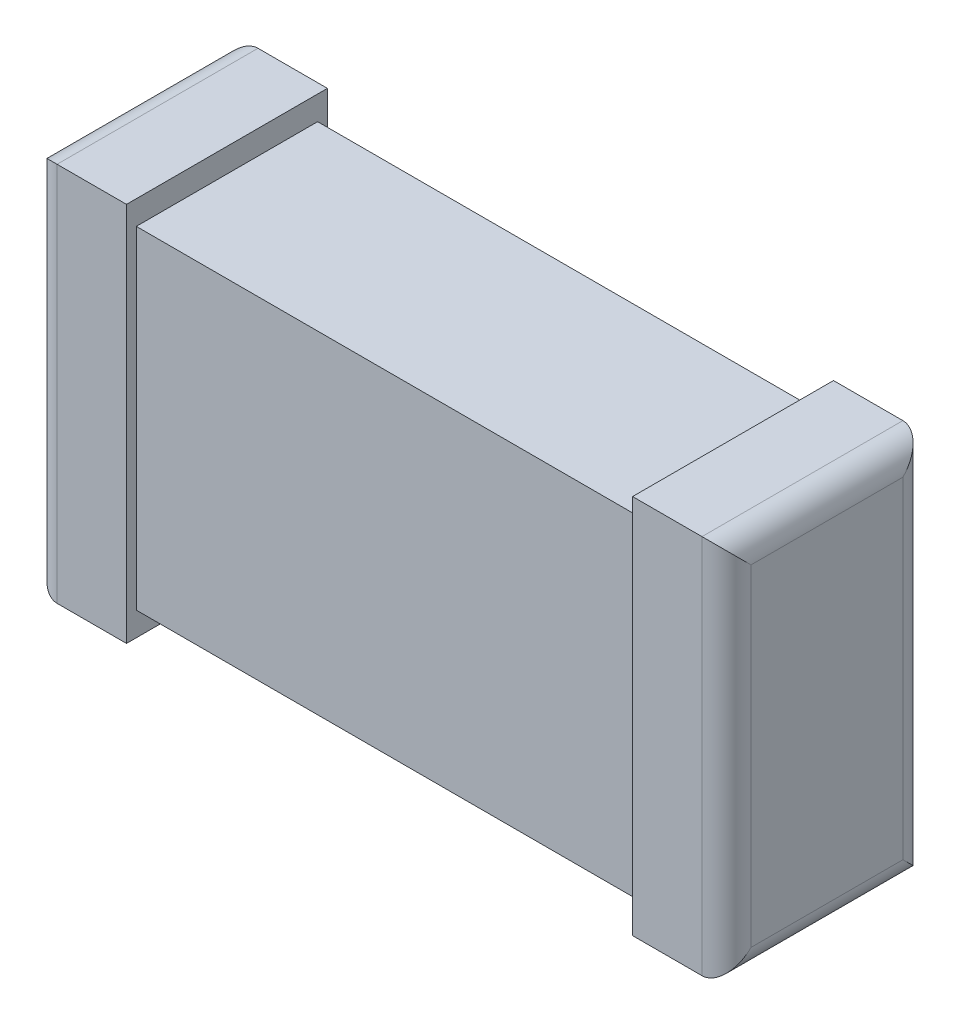
ISO-10303-21;
HEADER;
FILE_DESCRIPTION(('STEP AP214'),'2;1');
FILE_NAME('part.step','',(''),(''),'','','');
FILE_SCHEMA(('AUTOMOTIVE_DESIGN { 1 0 10303 214 1 1 1 1 }'));
ENDSEC;
DATA;
#1=APPLICATION_CONTEXT('core data for automotive mechanical design processes');
#2=APPLICATION_PROTOCOL_DEFINITION('international standard','automotive_design',2000,#1);
#3=PRODUCT_CONTEXT('',#1,'mechanical');
#4=PRODUCT('Part','Part','',(#3));
#5=PRODUCT_RELATED_PRODUCT_CATEGORY('part','',(#4));
#6=PRODUCT_DEFINITION_FORMATION('','',#4);
#7=PRODUCT_DEFINITION_CONTEXT('part definition',#1,'design');
#8=PRODUCT_DEFINITION('design','',#6,#7);
#9=PRODUCT_DEFINITION_SHAPE('','',#8);
#10=(LENGTH_UNIT() NAMED_UNIT(*) SI_UNIT(.MILLI.,.METRE.));
#11=(NAMED_UNIT(*) PLANE_ANGLE_UNIT() SI_UNIT($,.RADIAN.));
#12=(NAMED_UNIT(*) SI_UNIT($,.STERADIAN.) SOLID_ANGLE_UNIT());
#13=UNCERTAINTY_MEASURE_WITH_UNIT(LENGTH_MEASURE(1.E-05),#10,'distance_accuracy_value','');
#14=(GEOMETRIC_REPRESENTATION_CONTEXT(3) GLOBAL_UNCERTAINTY_ASSIGNED_CONTEXT((#13)) GLOBAL_UNIT_ASSIGNED_CONTEXT((#10,
#11,#12)) REPRESENTATION_CONTEXT('',''));
#15=CARTESIAN_POINT('',(0.,0.,0.));
#16=DIRECTION('',(0.,0.,1.));
#17=DIRECTION('',(1.,0.,0.));
#18=AXIS2_PLACEMENT_3D('',#15,#16,#17);
#19=CARTESIAN_POINT('',(-2.5818060220749,-1.69545951022299,0.));
#20=DIRECTION('',(0.,1.,0.));
#21=DIRECTION('',(-1.,0.,0.));
#22=AXIS2_PLACEMENT_3D('',#19,#20,#21);
#23=PLANE('',#22);
#24=DIRECTION('',(-1.,0.,0.));
#25=VECTOR('',#24,1.);
#26=CARTESIAN_POINT('',(2.5818060220749,-1.69545951022299,0.1));
#27=LINE('',#26,#25);
#28=CARTESIAN_POINT('',(2.5818060220749,-1.69545951022299,0.1));
#29=VERTEX_POINT('',#28);
#30=CARTESIAN_POINT('',(-2.5818060220749,-1.69545951022299,0.1));
#31=VERTEX_POINT('',#30);
#32=EDGE_CURVE('E173',#29,#31,#27,.T.);
#33=ORIENTED_EDGE('',*,*,#32,.F.);
#34=DIRECTION('',(0.,0.,1.));
#35=VECTOR('',#34,1.);
#36=CARTESIAN_POINT('',(2.5818060220749,-1.69545951022298,0.));
#37=LINE('',#36,#35);
#38=CARTESIAN_POINT('',(2.5818060220749,-1.69545951022299,1.95));
#39=VERTEX_POINT('',#38);
#40=EDGE_CURVE('E210',#29,#39,#37,.T.);
#41=ORIENTED_EDGE('',*,*,#40,.T.);
#42=DIRECTION('',(1.,0.,0.));
#43=VECTOR('',#42,1.);
#44=CARTESIAN_POINT('',(2.5818060220749,-1.69545951022299,1.95));
#45=LINE('',#44,#43);
#46=CARTESIAN_POINT('',(-2.5818060220749,-1.69545951022299,1.95));
#47=VERTEX_POINT('',#46);
#48=EDGE_CURVE('E409',#47,#39,#45,.T.);
#49=ORIENTED_EDGE('',*,*,#48,.F.);
#50=DIRECTION('',(0.,0.,1.));
#51=VECTOR('',#50,1.);
#52=CARTESIAN_POINT('',(-2.5818060220749,-1.69545951022299,0.));
#53=LINE('',#52,#51);
#54=EDGE_CURVE('E207',#31,#47,#53,.T.);
#55=ORIENTED_EDGE('',*,*,#54,.F.);
#56=EDGE_LOOP('',(#33,#41,#49,#55));
#57=FACE_BOUND('',#56,.T.);
#58=ADVANCED_FACE('F45',(#57),#23,.F.);
#59=CARTESIAN_POINT('',(-2.5818060220749,1.69545951022299,0.));
#60=DIRECTION('',(0.,-1.,0.));
#61=DIRECTION('',(0.,0.,-1.));
#62=AXIS2_PLACEMENT_3D('',#59,#60,#61);
#63=PLANE('',#62);
#64=DIRECTION('',(1.,0.,0.));
#65=VECTOR('',#64,1.);
#66=CARTESIAN_POINT('',(2.5818060220749,1.69545951022299,0.1));
#67=LINE('',#66,#65);
#68=CARTESIAN_POINT('',(-2.5818060220749,1.69545951022299,0.1));
#69=VERTEX_POINT('',#68);
#70=CARTESIAN_POINT('',(2.5818060220749,1.69545951022299,0.1));
#71=VERTEX_POINT('',#70);
#72=EDGE_CURVE('E170',#69,#71,#67,.T.);
#73=ORIENTED_EDGE('',*,*,#72,.F.);
#74=DIRECTION('',(0.,0.,1.));
#75=VECTOR('',#74,1.);
#76=CARTESIAN_POINT('',(-2.5818060220749,1.69545951022299,0.));
#77=LINE('',#76,#75);
#78=CARTESIAN_POINT('',(-2.5818060220749,1.69545951022299,1.95));
#79=VERTEX_POINT('',#78);
#80=EDGE_CURVE('E183',#69,#79,#77,.T.);
#81=ORIENTED_EDGE('',*,*,#80,.T.);
#82=DIRECTION('',(-1.,0.,0.));
#83=VECTOR('',#82,1.);
#84=CARTESIAN_POINT('',(2.5818060220749,1.69545951022299,1.95));
#85=LINE('',#84,#83);
#86=CARTESIAN_POINT('',(2.5818060220749,1.69545951022299,1.95));
#87=VERTEX_POINT('',#86);
#88=EDGE_CURVE('E213',#87,#79,#85,.T.);
#89=ORIENTED_EDGE('',*,*,#88,.F.);
#90=DIRECTION('',(0.,0.,1.));
#91=VECTOR('',#90,1.);
#92=CARTESIAN_POINT('',(2.5818060220749,1.69545951022299,0.));
#93=LINE('',#92,#91);
#94=EDGE_CURVE('E185',#71,#87,#93,.T.);
#95=ORIENTED_EDGE('',*,*,#94,.F.);
#96=EDGE_LOOP('',(#73,#81,#89,#95));
#97=FACE_BOUND('',#96,.T.);
#98=ADVANCED_FACE('F181',(#97),#63,.F.);
#99=CARTESIAN_POINT('',(0.,0.,0.));
#100=DIRECTION('',(0.,0.,-1.));
#101=DIRECTION('',(-1.,0.,0.));
#102=AXIS2_PLACEMENT_3D('',#99,#100,#101);
#103=PLANE('',#102);
#104=DIRECTION('',(1.,0.,0.));
#105=VECTOR('',#104,1.);
#106=CARTESIAN_POINT('',(-3.54,-1.94,0.));
#107=LINE('',#106,#105);
#108=CARTESIAN_POINT('',(-3.29,-1.94,0.));
#109=VERTEX_POINT('',#108);
#110=CARTESIAN_POINT('',(-2.5818060220749,-1.94,0.));
#111=VERTEX_POINT('',#110);
#112=EDGE_CURVE('E243',#109,#111,#107,.T.);
#113=ORIENTED_EDGE('',*,*,#112,.F.);
#114=DIRECTION('',(0.,-1.,0.));
#115=VECTOR('',#114,1.);
#116=CARTESIAN_POINT('',(-3.29,1.94,0.));
#117=LINE('',#116,#115);
#118=CARTESIAN_POINT('',(-3.29,1.94,0.));
#119=VERTEX_POINT('',#118);
#120=EDGE_CURVE('E292',#109,#119,#117,.F.);
#121=ORIENTED_EDGE('',*,*,#120,.T.);
#122=DIRECTION('',(-1.,0.,0.));
#123=VECTOR('',#122,1.);
#124=CARTESIAN_POINT('',(-3.54,1.94,0.));
#125=LINE('',#124,#123);
#126=CARTESIAN_POINT('',(-2.5818060220749,1.94,0.));
#127=VERTEX_POINT('',#126);
#128=EDGE_CURVE('E229',#127,#119,#125,.T.);
#129=ORIENTED_EDGE('',*,*,#128,.F.);
#130=DIRECTION('',(0.,1.,0.));
#131=VECTOR('',#130,1.);
#132=CARTESIAN_POINT('',(-2.5818060220749,0.,0.));
#133=LINE('',#132,#131);
#134=EDGE_CURVE('E248',#111,#127,#133,.T.);
#135=ORIENTED_EDGE('',*,*,#134,.F.);
#136=EDGE_LOOP('',(#113,#121,#129,#135));
#137=FACE_BOUND('',#136,.T.);
#138=ADVANCED_FACE('F338',(#137),#103,.T.);
#139=CARTESIAN_POINT('',(0.,0.,2.05));
#140=DIRECTION('',(0.,0.,-1.));
#141=DIRECTION('',(-1.,0.,0.));
#142=AXIS2_PLACEMENT_3D('',#139,#140,#141);
#143=PLANE('',#142);
#144=DIRECTION('',(-1.,0.,0.));
#145=VECTOR('',#144,1.);
#146=CARTESIAN_POINT('',(-3.54,1.94,2.05));
#147=LINE('',#146,#145);
#148=CARTESIAN_POINT('',(-2.5818060220749,1.94,2.05));
#149=VERTEX_POINT('',#148);
#150=CARTESIAN_POINT('',(-3.29,1.94,2.05));
#151=VERTEX_POINT('',#150);
#152=EDGE_CURVE('E234',#149,#151,#147,.T.);
#153=ORIENTED_EDGE('',*,*,#152,.T.);
#154=DIRECTION('',(0.,-1.,0.));
#155=VECTOR('',#154,1.);
#156=CARTESIAN_POINT('',(-3.29,0.,2.05));
#157=LINE('',#156,#155);
#158=CARTESIAN_POINT('',(-3.29,-1.94,2.05));
#159=VERTEX_POINT('',#158);
#160=EDGE_CURVE('E11',#151,#159,#157,.T.);
#161=ORIENTED_EDGE('',*,*,#160,.T.);
#162=DIRECTION('',(1.,0.,0.));
#163=VECTOR('',#162,1.);
#164=CARTESIAN_POINT('',(-3.54,-1.94,2.05));
#165=LINE('',#164,#163);
#166=CARTESIAN_POINT('',(-2.5818060220749,-1.94,2.05));
#167=VERTEX_POINT('',#166);
#168=EDGE_CURVE('E235',#159,#167,#165,.T.);
#169=ORIENTED_EDGE('',*,*,#168,.T.);
#170=DIRECTION('',(0.,-1.,0.));
#171=VECTOR('',#170,1.);
#172=CARTESIAN_POINT('',(-2.5818060220749,2.18454048977701,2.05));
#173=LINE('',#172,#171);
#174=EDGE_CURVE('E195',#149,#167,#173,.T.);
#175=ORIENTED_EDGE('',*,*,#174,.F.);
#176=EDGE_LOOP('',(#153,#161,#169,#175));
#177=FACE_BOUND('',#176,.T.);
#178=ADVANCED_FACE('F379',(#177),#143,.F.);
#179=CARTESIAN_POINT('',(-3.54,1.94,2.05));
#180=DIRECTION('',(0.,-1.,0.));
#181=DIRECTION('',(0.,0.,-1.));
#182=AXIS2_PLACEMENT_3D('',#179,#180,#181);
#183=PLANE('',#182);
#184=CARTESIAN_POINT('',(3.29,1.94,2.05));
#185=VERTEX_POINT('',#184);
#186=CARTESIAN_POINT('',(2.5818060220749,1.94,2.05));
#187=VERTEX_POINT('',#186);
#188=EDGE_CURVE('E230',#185,#187,#147,.T.);
#189=ORIENTED_EDGE('',*,*,#188,.F.);
#190=DIRECTION('',(0.,0.,-1.));
#191=VECTOR('',#190,1.);
#192=CARTESIAN_POINT('',(3.29,1.94,2.05));
#193=LINE('',#192,#191);
#194=CARTESIAN_POINT('',(3.29,1.94,0.));
#195=VERTEX_POINT('',#194);
#196=EDGE_CURVE('E272',#185,#195,#193,.T.);
#197=ORIENTED_EDGE('',*,*,#196,.T.);
#198=CARTESIAN_POINT('',(2.5818060220749,1.94,0.));
#199=VERTEX_POINT('',#198);
#200=EDGE_CURVE('E239',#195,#199,#125,.T.);
#201=ORIENTED_EDGE('',*,*,#200,.T.);
#202=DIRECTION('',(0.,0.,1.));
#203=VECTOR('',#202,1.);
#204=CARTESIAN_POINT('',(2.5818060220749,1.94,2.05));
#205=LINE('',#204,#203);
#206=EDGE_CURVE('E225',#199,#187,#205,.T.);
#207=ORIENTED_EDGE('',*,*,#206,.T.);
#208=EDGE_LOOP('',(#189,#197,#201,#207));
#209=FACE_BOUND('',#208,.T.);
#210=ADVANCED_FACE('F363',(#209),#183,.F.);
#211=CARTESIAN_POINT('',(-3.54,-1.94,2.05));
#212=DIRECTION('',(0.,1.,0.));
#213=DIRECTION('',(0.,0.,1.));
#214=AXIS2_PLACEMENT_3D('',#211,#212,#213);
#215=PLANE('',#214);
#216=ORIENTED_EDGE('',*,*,#168,.F.);
#217=DIRECTION('',(0.,0.,-1.));
#218=VECTOR('',#217,1.);
#219=CARTESIAN_POINT('',(-3.29,-1.94,2.05));
#220=LINE('',#219,#218);
#221=EDGE_CURVE('E55',#159,#109,#220,.T.);
#222=ORIENTED_EDGE('',*,*,#221,.T.);
#223=ORIENTED_EDGE('',*,*,#112,.T.);
#224=DIRECTION('',(0.,0.,1.));
#225=VECTOR('',#224,1.);
#226=CARTESIAN_POINT('',(-2.5818060220749,-1.94,2.05));
#227=LINE('',#226,#225);
#228=EDGE_CURVE('E217',#111,#167,#227,.T.);
#229=ORIENTED_EDGE('',*,*,#228,.T.);
#230=EDGE_LOOP('',(#216,#222,#223,#229));
#231=FACE_BOUND('',#230,.T.);
#232=ADVANCED_FACE('F360',(#231),#215,.F.);
#233=CARTESIAN_POINT('',(3.54,-1.94,2.05));
#234=DIRECTION('',(-1.,0.,0.));
#235=DIRECTION('',(0.,0.,1.));
#236=AXIS2_PLACEMENT_3D('',#233,#234,#235);
#237=PLANE('',#236);
#238=DIRECTION('',(0.,1.,0.));
#239=VECTOR('',#238,1.);
#240=CARTESIAN_POINT('',(3.54,-1.94,1.8));
#241=LINE('',#240,#239);
#242=CARTESIAN_POINT('',(3.54,1.69,1.8));
#243=VERTEX_POINT('',#242);
#244=CARTESIAN_POINT('',(3.54,-1.69,1.8));
#245=VERTEX_POINT('',#244);
#246=EDGE_CURVE('E253',#243,#245,#241,.F.);
#247=ORIENTED_EDGE('',*,*,#246,.T.);
#248=DIRECTION('',(0.,0.,-1.));
#249=VECTOR('',#248,1.);
#250=CARTESIAN_POINT('',(3.54,-1.69,2.05));
#251=LINE('',#250,#249);
#252=CARTESIAN_POINT('',(3.54,-1.69,0.25));
#253=VERTEX_POINT('',#252);
#254=EDGE_CURVE('E259',#245,#253,#251,.T.);
#255=ORIENTED_EDGE('',*,*,#254,.T.);
#256=DIRECTION('',(0.,1.,0.));
#257=VECTOR('',#256,1.);
#258=CARTESIAN_POINT('',(3.54,1.94,0.25));
#259=LINE('',#258,#257);
#260=CARTESIAN_POINT('',(3.54,1.69,0.25));
#261=VERTEX_POINT('',#260);
#262=EDGE_CURVE('E256',#253,#261,#259,.T.);
#263=ORIENTED_EDGE('',*,*,#262,.T.);
#264=DIRECTION('',(0.,0.,-1.));
#265=VECTOR('',#264,1.);
#266=CARTESIAN_POINT('',(3.54,1.69,2.05));
#267=LINE('',#266,#265);
#268=EDGE_CURVE('E250',#261,#243,#267,.F.);
#269=ORIENTED_EDGE('',*,*,#268,.T.);
#270=EDGE_LOOP('',(#247,#255,#263,#269));
#271=FACE_BOUND('',#270,.T.);
#272=ADVANCED_FACE('F361',(#271),#237,.F.);
#273=ORIENTED_EDGE('',*,*,#128,.T.);
#274=DIRECTION('',(0.,0.,-1.));
#275=VECTOR('',#274,1.);
#276=CARTESIAN_POINT('',(-3.29,1.94,2.05));
#277=LINE('',#276,#275);
#278=EDGE_CURVE('E288',#119,#151,#277,.F.);
#279=ORIENTED_EDGE('',*,*,#278,.T.);
#280=ORIENTED_EDGE('',*,*,#152,.F.);
#281=DIRECTION('',(0.,0.,-1.));
#282=VECTOR('',#281,1.);
#283=CARTESIAN_POINT('',(-2.5818060220749,1.94,2.05));
#284=LINE('',#283,#282);
#285=EDGE_CURVE('E221',#149,#127,#284,.T.);
#286=ORIENTED_EDGE('',*,*,#285,.T.);
#287=EDGE_LOOP('',(#273,#279,#280,#286));
#288=FACE_BOUND('',#287,.T.);
#289=ADVANCED_FACE('F342',(#288),#183,.F.);
#290=CARTESIAN_POINT('',(-3.54,-1.94,2.05));
#291=DIRECTION('',(1.,0.,0.));
#292=DIRECTION('',(0.,0.,-1.));
#293=AXIS2_PLACEMENT_3D('',#290,#291,#292);
#294=PLANE('',#293);
#295=DIRECTION('',(0.,-1.,0.));
#296=VECTOR('',#295,1.);
#297=CARTESIAN_POINT('',(-3.54,-1.94,1.8));
#298=LINE('',#297,#296);
#299=CARTESIAN_POINT('',(-3.54,-1.69,1.8));
#300=VERTEX_POINT('',#299);
#301=CARTESIAN_POINT('',(-3.54,1.69,1.8));
#302=VERTEX_POINT('',#301);
#303=EDGE_CURVE('E275',#300,#302,#298,.F.);
#304=ORIENTED_EDGE('',*,*,#303,.T.);
#305=DIRECTION('',(0.,0.,-1.));
#306=VECTOR('',#305,1.);
#307=CARTESIAN_POINT('',(-3.54,1.69,2.05));
#308=LINE('',#307,#306);
#309=CARTESIAN_POINT('',(-3.54,1.69,0.25));
#310=VERTEX_POINT('',#309);
#311=EDGE_CURVE('E284',#302,#310,#308,.T.);
#312=ORIENTED_EDGE('',*,*,#311,.T.);
#313=DIRECTION('',(0.,-1.,0.));
#314=VECTOR('',#313,1.);
#315=CARTESIAN_POINT('',(-3.54,-1.94,0.25));
#316=LINE('',#315,#314);
#317=CARTESIAN_POINT('',(-3.54,-1.69,0.25));
#318=VERTEX_POINT('',#317);
#319=EDGE_CURVE('E281',#310,#318,#316,.T.);
#320=ORIENTED_EDGE('',*,*,#319,.T.);
#321=DIRECTION('',(0.,0.,-1.));
#322=VECTOR('',#321,1.);
#323=CARTESIAN_POINT('',(-3.54,-1.69,2.05));
#324=LINE('',#323,#322);
#325=EDGE_CURVE('E278',#318,#300,#324,.F.);
#326=ORIENTED_EDGE('',*,*,#325,.T.);
#327=EDGE_LOOP('',(#304,#312,#320,#326));
#328=FACE_BOUND('',#327,.T.);
#329=ADVANCED_FACE('F349',(#328),#294,.F.);
#330=CARTESIAN_POINT('',(2.5818060220749,-1.94,0.));
#331=VERTEX_POINT('',#330);
#332=CARTESIAN_POINT('',(3.29,-1.94,0.));
#333=VERTEX_POINT('',#332);
#334=EDGE_CURVE('E242',#331,#333,#107,.T.);
#335=ORIENTED_EDGE('',*,*,#334,.T.);
#336=DIRECTION('',(0.,0.,-1.));
#337=VECTOR('',#336,1.);
#338=CARTESIAN_POINT('',(3.29,-1.94,2.05));
#339=LINE('',#338,#337);
#340=CARTESIAN_POINT('',(3.29,-1.94,2.05));
#341=VERTEX_POINT('',#340);
#342=EDGE_CURVE('E263',#333,#341,#339,.F.);
#343=ORIENTED_EDGE('',*,*,#342,.T.);
#344=CARTESIAN_POINT('',(2.5818060220749,-1.94,2.05));
#345=VERTEX_POINT('',#344);
#346=EDGE_CURVE('E233',#345,#341,#165,.T.);
#347=ORIENTED_EDGE('',*,*,#346,.F.);
#348=DIRECTION('',(0.,0.,-1.));
#349=VECTOR('',#348,1.);
#350=CARTESIAN_POINT('',(2.5818060220749,-1.94,2.05));
#351=LINE('',#350,#349);
#352=EDGE_CURVE('E200',#345,#331,#351,.T.);
#353=ORIENTED_EDGE('',*,*,#352,.T.);
#354=EDGE_LOOP('',(#335,#343,#347,#353));
#355=FACE_BOUND('',#354,.T.);
#356=ADVANCED_FACE('F351',(#355),#215,.F.);
#357=ORIENTED_EDGE('',*,*,#346,.T.);
#358=DIRECTION('',(0.,1.,0.));
#359=VECTOR('',#358,1.);
#360=CARTESIAN_POINT('',(3.29,0.,2.05));
#361=LINE('',#360,#359);
#362=EDGE_CURVE('E269',#341,#185,#361,.T.);
#363=ORIENTED_EDGE('',*,*,#362,.T.);
#364=ORIENTED_EDGE('',*,*,#188,.T.);
#365=DIRECTION('',(0.,1.,0.));
#366=VECTOR('',#365,1.);
#367=CARTESIAN_POINT('',(2.5818060220749,2.18454048977701,2.05));
#368=LINE('',#367,#366);
#369=EDGE_CURVE('E204',#345,#187,#368,.T.);
#370=ORIENTED_EDGE('',*,*,#369,.F.);
#371=EDGE_LOOP('',(#357,#363,#364,#370));
#372=FACE_BOUND('',#371,.T.);
#373=ADVANCED_FACE('F357',(#372),#143,.F.);
#374=ORIENTED_EDGE('',*,*,#200,.F.);
#375=DIRECTION('',(0.,1.,0.));
#376=VECTOR('',#375,1.);
#377=CARTESIAN_POINT('',(3.29,-1.94,0.));
#378=LINE('',#377,#376);
#379=EDGE_CURVE('E267',#195,#333,#378,.F.);
#380=ORIENTED_EDGE('',*,*,#379,.T.);
#381=ORIENTED_EDGE('',*,*,#334,.F.);
#382=DIRECTION('',(0.,-1.,0.));
#383=VECTOR('',#382,1.);
#384=CARTESIAN_POINT('',(2.5818060220749,0.,0.));
#385=LINE('',#384,#383);
#386=EDGE_CURVE('E238',#199,#331,#385,.T.);
#387=ORIENTED_EDGE('',*,*,#386,.F.);
#388=EDGE_LOOP('',(#374,#380,#381,#387));
#389=FACE_BOUND('',#388,.T.);
#390=ADVANCED_FACE('F377',(#389),#103,.T.);
#391=CARTESIAN_POINT('',(2.5818060220749,2.18454048977701,0.));
#392=DIRECTION('',(1.,0.,0.));
#393=DIRECTION('',(0.,0.,-1.));
#394=AXIS2_PLACEMENT_3D('',#391,#392,#393);
#395=PLANE('',#394);
#396=ORIENTED_EDGE('',*,*,#40,.F.);
#397=DIRECTION('',(0.,-1.,0.));
#398=VECTOR('',#397,1.);
#399=CARTESIAN_POINT('',(2.5818060220749,1.69545951022299,0.1));
#400=LINE('',#399,#398);
#401=EDGE_CURVE('E187',#71,#29,#400,.T.);
#402=ORIENTED_EDGE('',*,*,#401,.F.);
#403=ORIENTED_EDGE('',*,*,#94,.T.);
#404=DIRECTION('',(0.,1.,0.));
#405=VECTOR('',#404,1.);
#406=CARTESIAN_POINT('',(2.5818060220749,-1.69545951022299,1.95));
#407=LINE('',#406,#405);
#408=EDGE_CURVE('E432',#39,#87,#407,.T.);
#409=ORIENTED_EDGE('',*,*,#408,.F.);
#410=EDGE_LOOP('',(#396,#402,#403,#409));
#411=FACE_BOUND('',#410,.T.);
#412=ORIENTED_EDGE('',*,*,#206,.F.);
#413=ORIENTED_EDGE('',*,*,#386,.T.);
#414=ORIENTED_EDGE('',*,*,#352,.F.);
#415=ORIENTED_EDGE('',*,*,#369,.T.);
#416=EDGE_LOOP('',(#412,#413,#414,#415));
#417=FACE_BOUND('',#416,.T.);
#418=ADVANCED_FACE('F373',(#411,#417),#395,.F.);
#419=CARTESIAN_POINT('',(-2.5818060220749,2.18454048977701,0.));
#420=DIRECTION('',(-1.,0.,0.));
#421=DIRECTION('',(0.,0.,1.));
#422=AXIS2_PLACEMENT_3D('',#419,#420,#421);
#423=PLANE('',#422);
#424=DIRECTION('',(0.,1.,0.));
#425=VECTOR('',#424,1.);
#426=CARTESIAN_POINT('',(-2.5818060220749,1.69545951022299,0.1));
#427=LINE('',#426,#425);
#428=EDGE_CURVE('E167',#31,#69,#427,.T.);
#429=ORIENTED_EDGE('',*,*,#428,.F.);
#430=ORIENTED_EDGE('',*,*,#54,.T.);
#431=DIRECTION('',(0.,-1.,0.));
#432=VECTOR('',#431,1.);
#433=CARTESIAN_POINT('',(-2.5818060220749,-1.69545951022299,1.95));
#434=LINE('',#433,#432);
#435=EDGE_CURVE('E192',#79,#47,#434,.T.);
#436=ORIENTED_EDGE('',*,*,#435,.F.);
#437=ORIENTED_EDGE('',*,*,#80,.F.);
#438=EDGE_LOOP('',(#429,#430,#436,#437));
#439=FACE_BOUND('',#438,.T.);
#440=ORIENTED_EDGE('',*,*,#174,.T.);
#441=ORIENTED_EDGE('',*,*,#228,.F.);
#442=ORIENTED_EDGE('',*,*,#134,.T.);
#443=ORIENTED_EDGE('',*,*,#285,.F.);
#444=EDGE_LOOP('',(#440,#441,#442,#443));
#445=FACE_BOUND('',#444,.T.);
#446=ADVANCED_FACE('F189',(#439,#445),#423,.F.);
#447=CARTESIAN_POINT('',(0.,0.,1.95));
#448=DIRECTION('',(0.,0.,1.));
#449=DIRECTION('',(1.,0.,0.));
#450=AXIS2_PLACEMENT_3D('',#447,#448,#449);
#451=PLANE('',#450);
#452=ORIENTED_EDGE('',*,*,#435,.T.);
#453=ORIENTED_EDGE('',*,*,#48,.T.);
#454=ORIENTED_EDGE('',*,*,#408,.T.);
#455=ORIENTED_EDGE('',*,*,#88,.T.);
#456=EDGE_LOOP('',(#452,#453,#454,#455));
#457=FACE_BOUND('',#456,.T.);
#458=ADVANCED_FACE('F447',(#457),#451,.T.);
#459=CARTESIAN_POINT('',(0.,0.,0.1));
#460=DIRECTION('',(0.,0.,-1.));
#461=DIRECTION('',(-1.,0.,0.));
#462=AXIS2_PLACEMENT_3D('',#459,#460,#461);
#463=PLANE('',#462);
#464=ORIENTED_EDGE('',*,*,#428,.T.);
#465=ORIENTED_EDGE('',*,*,#72,.T.);
#466=ORIENTED_EDGE('',*,*,#401,.T.);
#467=ORIENTED_EDGE('',*,*,#32,.T.);
#468=EDGE_LOOP('',(#464,#465,#466,#467));
#469=FACE_BOUND('',#468,.T.);
#470=ADVANCED_FACE('F169',(#469),#463,.T.);
#471=CARTESIAN_POINT('',(3.29,1.69,2.05));
#472=DIRECTION('',(0.,0.,-1.));
#473=DIRECTION('',(-1.,0.,0.));
#474=AXIS2_PLACEMENT_3D('',#471,#472,#473);
#475=CYLINDRICAL_SURFACE('',#474,0.25);
#476=CARTESIAN_POINT('',(3.29,1.69,0.25));
#477=DIRECTION('',(0.,-0.707106781186547,-0.707106781186547));
#478=DIRECTION('',(0.,0.707106781186547,-0.707106781186547));
#479=AXIS2_PLACEMENT_3D('',#476,#477,#478);
#480=ELLIPSE('',#479,0.353553390593274,0.25);
#481=EDGE_CURVE('E303',#195,#261,#480,.T.);
#482=ORIENTED_EDGE('',*,*,#481,.F.);
#483=ORIENTED_EDGE('',*,*,#196,.F.);
#484=CARTESIAN_POINT('',(3.29,1.69,1.8));
#485=DIRECTION('',(0.,0.707106781186547,-0.707106781186547));
#486=DIRECTION('',(0.,-0.707106781186547,-0.707106781186547));
#487=AXIS2_PLACEMENT_3D('',#484,#485,#486);
#488=ELLIPSE('',#487,0.353553390593274,0.25);
#489=EDGE_CURVE('E178',#243,#185,#488,.F.);
#490=ORIENTED_EDGE('',*,*,#489,.F.);
#491=ORIENTED_EDGE('',*,*,#268,.F.);
#492=EDGE_LOOP('',(#482,#483,#490,#491));
#493=FACE_BOUND('',#492,.T.);
#494=ADVANCED_FACE('F478',(#493),#475,.T.);
#495=CARTESIAN_POINT('',(3.29,0.,1.8));
#496=DIRECTION('',(0.,1.,0.));
#497=DIRECTION('',(0.,0.,1.));
#498=AXIS2_PLACEMENT_3D('',#495,#496,#497);
#499=CYLINDRICAL_SURFACE('',#498,0.25);
#500=ORIENTED_EDGE('',*,*,#489,.T.);
#501=ORIENTED_EDGE('',*,*,#362,.F.);
#502=CARTESIAN_POINT('',(3.29,-1.69,1.8));
#503=DIRECTION('',(0.,0.707106781186547,0.707106781186547));
#504=DIRECTION('',(0.,0.707106781186547,-0.707106781186547));
#505=AXIS2_PLACEMENT_3D('',#502,#503,#504);
#506=ELLIPSE('',#505,0.353553390593274,0.25);
#507=EDGE_CURVE('E300',#245,#341,#506,.F.);
#508=ORIENTED_EDGE('',*,*,#507,.F.);
#509=ORIENTED_EDGE('',*,*,#246,.F.);
#510=EDGE_LOOP('',(#500,#501,#508,#509));
#511=FACE_BOUND('',#510,.T.);
#512=ADVANCED_FACE('F476',(#511),#499,.T.);
#513=CARTESIAN_POINT('',(3.29,-1.94,0.25));
#514=DIRECTION('',(0.,-1.,0.));
#515=DIRECTION('',(0.,0.,-1.));
#516=AXIS2_PLACEMENT_3D('',#513,#514,#515);
#517=CYLINDRICAL_SURFACE('',#516,0.25);
#518=ORIENTED_EDGE('',*,*,#481,.T.);
#519=ORIENTED_EDGE('',*,*,#262,.F.);
#520=CARTESIAN_POINT('',(3.29,-1.69,0.25));
#521=DIRECTION('',(0.,-0.707106781186547,0.707106781186547));
#522=DIRECTION('',(0.,-0.707106781186547,-0.707106781186547));
#523=AXIS2_PLACEMENT_3D('',#520,#521,#522);
#524=ELLIPSE('',#523,0.353553390593274,0.25);
#525=EDGE_CURVE('E297',#333,#253,#524,.T.);
#526=ORIENTED_EDGE('',*,*,#525,.F.);
#527=ORIENTED_EDGE('',*,*,#379,.F.);
#528=EDGE_LOOP('',(#518,#519,#526,#527));
#529=FACE_BOUND('',#528,.T.);
#530=ADVANCED_FACE('F470',(#529),#517,.T.);
#531=CARTESIAN_POINT('',(3.29,-1.69,2.05));
#532=DIRECTION('',(0.,0.,-1.));
#533=DIRECTION('',(-1.,0.,0.));
#534=AXIS2_PLACEMENT_3D('',#531,#532,#533);
#535=CYLINDRICAL_SURFACE('',#534,0.25);
#536=ORIENTED_EDGE('',*,*,#507,.T.);
#537=ORIENTED_EDGE('',*,*,#342,.F.);
#538=ORIENTED_EDGE('',*,*,#525,.T.);
#539=ORIENTED_EDGE('',*,*,#254,.F.);
#540=EDGE_LOOP('',(#536,#537,#538,#539));
#541=FACE_BOUND('',#540,.T.);
#542=ADVANCED_FACE('F464',(#541),#535,.T.);
#543=CARTESIAN_POINT('',(-3.29,-1.69,2.05));
#544=DIRECTION('',(0.,0.,-1.));
#545=DIRECTION('',(-1.,0.,0.));
#546=AXIS2_PLACEMENT_3D('',#543,#544,#545);
#547=CYLINDRICAL_SURFACE('',#546,0.25);
#548=CARTESIAN_POINT('',(-3.29,-1.69,0.25));
#549=DIRECTION('',(0.,0.707106781186547,-0.707106781186547));
#550=DIRECTION('',(0.,-0.707106781186547,-0.707106781186547));
#551=AXIS2_PLACEMENT_3D('',#548,#549,#550);
#552=ELLIPSE('',#551,0.353553390593274,0.25);
#553=EDGE_CURVE('E315',#109,#318,#552,.T.);
#554=ORIENTED_EDGE('',*,*,#553,.F.);
#555=ORIENTED_EDGE('',*,*,#221,.F.);
#556=CARTESIAN_POINT('',(-3.29,-1.69,1.8));
#557=DIRECTION('',(0.,-0.707106781186547,-0.707106781186547));
#558=DIRECTION('',(0.,-0.707106781186547,0.707106781186547));
#559=AXIS2_PLACEMENT_3D('',#556,#557,#558);
#560=ELLIPSE('',#559,0.353553390593274,0.25);
#561=EDGE_CURVE('E49',#300,#159,#560,.F.);
#562=ORIENTED_EDGE('',*,*,#561,.F.);
#563=ORIENTED_EDGE('',*,*,#325,.F.);
#564=EDGE_LOOP('',(#554,#555,#562,#563));
#565=FACE_BOUND('',#564,.T.);
#566=ADVANCED_FACE('F47',(#565),#547,.T.);
#567=CARTESIAN_POINT('',(-3.29,0.,1.8));
#568=DIRECTION('',(0.,-1.,0.));
#569=DIRECTION('',(0.,0.,-1.));
#570=AXIS2_PLACEMENT_3D('',#567,#568,#569);
#571=CYLINDRICAL_SURFACE('',#570,0.25);
#572=ORIENTED_EDGE('',*,*,#561,.T.);
#573=ORIENTED_EDGE('',*,*,#160,.F.);
#574=CARTESIAN_POINT('',(-3.29,1.69,1.8));
#575=DIRECTION('',(0.,-0.707106781186547,0.707106781186547));
#576=DIRECTION('',(0.,-0.707106781186547,-0.707106781186547));
#577=AXIS2_PLACEMENT_3D('',#574,#575,#576);
#578=ELLIPSE('',#577,0.353553390593274,0.25);
#579=EDGE_CURVE('E313',#302,#151,#578,.F.);
#580=ORIENTED_EDGE('',*,*,#579,.F.);
#581=ORIENTED_EDGE('',*,*,#303,.F.);
#582=EDGE_LOOP('',(#572,#573,#580,#581));
#583=FACE_BOUND('',#582,.T.);
#584=ADVANCED_FACE('F329',(#583),#571,.T.);
#585=CARTESIAN_POINT('',(-3.29,-1.94,0.25));
#586=DIRECTION('',(0.,1.,0.));
#587=DIRECTION('',(0.,0.,1.));
#588=AXIS2_PLACEMENT_3D('',#585,#586,#587);
#589=CYLINDRICAL_SURFACE('',#588,0.25);
#590=ORIENTED_EDGE('',*,*,#553,.T.);
#591=ORIENTED_EDGE('',*,*,#319,.F.);
#592=CARTESIAN_POINT('',(-3.29,1.69,0.25));
#593=DIRECTION('',(0.,0.707106781186547,0.707106781186547));
#594=DIRECTION('',(0.,0.707106781186547,-0.707106781186547));
#595=AXIS2_PLACEMENT_3D('',#592,#593,#594);
#596=ELLIPSE('',#595,0.353553390593274,0.25);
#597=EDGE_CURVE('E310',#119,#310,#596,.T.);
#598=ORIENTED_EDGE('',*,*,#597,.F.);
#599=ORIENTED_EDGE('',*,*,#120,.F.);
#600=EDGE_LOOP('',(#590,#591,#598,#599));
#601=FACE_BOUND('',#600,.T.);
#602=ADVANCED_FACE('F334',(#601),#589,.T.);
#603=CARTESIAN_POINT('',(-3.29,1.69,2.05));
#604=DIRECTION('',(0.,0.,-1.));
#605=DIRECTION('',(-1.,0.,0.));
#606=AXIS2_PLACEMENT_3D('',#603,#604,#605);
#607=CYLINDRICAL_SURFACE('',#606,0.25);
#608=ORIENTED_EDGE('',*,*,#579,.T.);
#609=ORIENTED_EDGE('',*,*,#278,.F.);
#610=ORIENTED_EDGE('',*,*,#597,.T.);
#611=ORIENTED_EDGE('',*,*,#311,.F.);
#612=EDGE_LOOP('',(#608,#609,#610,#611));
#613=FACE_BOUND('',#612,.T.);
#614=ADVANCED_FACE('F346',(#613),#607,.T.);
#615=CLOSED_SHELL('',(#58,#98,#138,#178,#210,#232,#272,#289,#329,#356,#373,#390,#418,#446,#458,
#470,#494,#512,#530,#542,#566,#584,#602,#614));
#616=MANIFOLD_SOLID_BREP('B2',#615);
#617=ADVANCED_BREP_SHAPE_REPRESENTATION('',(#18,#616),#14);
#618=SHAPE_DEFINITION_REPRESENTATION(#9,#617);
ENDSEC;
END-ISO-10303-21;
